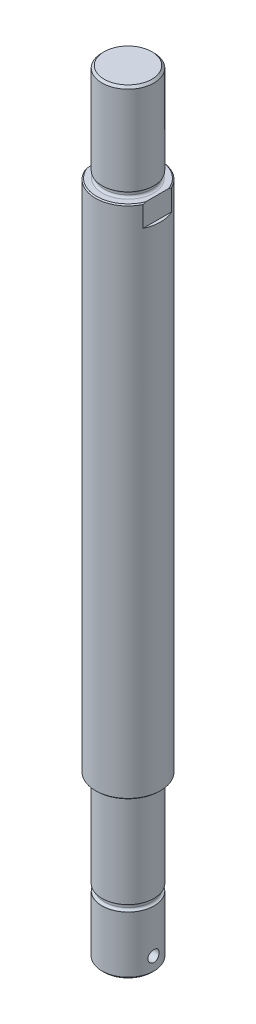
ISO-10303-21;
HEADER;
FILE_DESCRIPTION(('STEP AP214'),'2;1');
FILE_NAME('part.step','',(''),(''),'','','');
FILE_SCHEMA(('AUTOMOTIVE_DESIGN { 1 0 10303 214 1 1 1 1 }'));
ENDSEC;
DATA;
#1=APPLICATION_CONTEXT('core data for automotive mechanical design processes');
#2=APPLICATION_PROTOCOL_DEFINITION('international standard','automotive_design',2000,#1);
#3=PRODUCT_CONTEXT('',#1,'mechanical');
#4=PRODUCT('Part','Part','',(#3));
#5=PRODUCT_RELATED_PRODUCT_CATEGORY('part','',(#4));
#6=PRODUCT_DEFINITION_FORMATION('','',#4);
#7=PRODUCT_DEFINITION_CONTEXT('part definition',#1,'design');
#8=PRODUCT_DEFINITION('design','',#6,#7);
#9=PRODUCT_DEFINITION_SHAPE('','',#8);
#10=(LENGTH_UNIT() NAMED_UNIT(*) SI_UNIT(.MILLI.,.METRE.));
#11=(NAMED_UNIT(*) PLANE_ANGLE_UNIT() SI_UNIT($,.RADIAN.));
#12=(NAMED_UNIT(*) SI_UNIT($,.STERADIAN.) SOLID_ANGLE_UNIT());
#13=UNCERTAINTY_MEASURE_WITH_UNIT(LENGTH_MEASURE(1.E-05),#10,'distance_accuracy_value','');
#14=(GEOMETRIC_REPRESENTATION_CONTEXT(3) GLOBAL_UNCERTAINTY_ASSIGNED_CONTEXT((#13)) GLOBAL_UNIT_ASSIGNED_CONTEXT((#10,
#11,#12)) REPRESENTATION_CONTEXT('',''));
#15=CARTESIAN_POINT('',(0.,0.,0.));
#16=DIRECTION('',(0.,0.,1.));
#17=DIRECTION('',(1.,0.,0.));
#18=AXIS2_PLACEMENT_3D('',#15,#16,#17);
#19=CARTESIAN_POINT('',(0.,237.5,0.));
#20=DIRECTION('',(0.,1.,0.));
#21=DIRECTION('',(0.,0.,1.));
#22=AXIS2_PLACEMENT_3D('',#19,#20,#21);
#23=PLANE('',#22);
#24=CARTESIAN_POINT('',(0.,237.5,0.));
#25=DIRECTION('',(0.,1.,0.));
#26=DIRECTION('',(0.,0.,1.));
#27=AXIS2_PLACEMENT_3D('',#24,#25,#26);
#28=CIRCLE('',#27,11.85);
#29=CARTESIAN_POINT('',(0.,237.5,11.85));
#30=VERTEX_POINT('',#29);
#31=EDGE_CURVE('E113',#30,#30,#28,.F.);
#32=ORIENTED_EDGE('',*,*,#31,.T.);
#33=EDGE_LOOP('',(#32));
#34=FACE_BOUND('',#33,.T.);
#35=CARTESIAN_POINT('',(0.,237.5,0.));
#36=DIRECTION('',(0.,1.,0.));
#37=DIRECTION('',(0.,0.,1.));
#38=AXIS2_PLACEMENT_3D('',#35,#36,#37);
#39=CIRCLE('',#38,14.5);
#40=CARTESIAN_POINT('',(13.5,237.5,-5.29150262212917));
#41=VERTEX_POINT('',#40);
#42=CARTESIAN_POINT('',(-13.5,237.5,-5.29150262212918));
#43=VERTEX_POINT('',#42);
#44=EDGE_CURVE('E107',#41,#43,#39,.T.);
#45=ORIENTED_EDGE('',*,*,#44,.T.);
#46=DIRECTION('',(0.,0.,1.));
#47=VECTOR('',#46,1.);
#48=CARTESIAN_POINT('',(-13.5,237.5,-15.));
#49=LINE('',#48,#47);
#50=CARTESIAN_POINT('',(-13.5,237.5,5.29150262212918));
#51=VERTEX_POINT('',#50);
#52=EDGE_CURVE('E94',#43,#51,#49,.T.);
#53=ORIENTED_EDGE('',*,*,#52,.T.);
#54=CARTESIAN_POINT('',(13.5,237.5,5.29150262212918));
#55=VERTEX_POINT('',#54);
#56=EDGE_CURVE('E65',#51,#55,#39,.T.);
#57=ORIENTED_EDGE('',*,*,#56,.T.);
#58=DIRECTION('',(0.,0.,1.));
#59=VECTOR('',#58,1.);
#60=CARTESIAN_POINT('',(13.5,237.5,-15.));
#61=LINE('',#60,#59);
#62=EDGE_CURVE('E109',#41,#55,#61,.T.);
#63=ORIENTED_EDGE('',*,*,#62,.F.);
#64=EDGE_LOOP('',(#45,#53,#57,#63));
#65=FACE_BOUND('',#64,.T.);
#66=ADVANCED_FACE('F42',(#34,#65),#23,.T.);
#67=CARTESIAN_POINT('',(0.,237.5,0.));
#68=DIRECTION('',(0.,-1.,0.));
#69=DIRECTION('',(0.,0.,-1.));
#70=AXIS2_PLACEMENT_3D('',#67,#68,#69);
#71=CYLINDRICAL_SURFACE('',#70,15.);
#72=CARTESIAN_POINT('',(0.,0.500000000000084,0.));
#73=DIRECTION('',(0.,1.,0.));
#74=DIRECTION('',(0.,0.,1.));
#75=AXIS2_PLACEMENT_3D('',#72,#73,#74);
#76=CIRCLE('',#75,15.);
#77=CARTESIAN_POINT('',(0.,0.500000000000084,15.));
#78=VERTEX_POINT('',#77);
#79=EDGE_CURVE('E270',#78,#78,#76,.T.);
#80=ORIENTED_EDGE('',*,*,#79,.T.);
#81=EDGE_LOOP('',(#80));
#82=FACE_BOUND('',#81,.T.);
#83=DIRECTION('',(0.,-1.,0.));
#84=VECTOR('',#83,1.);
#85=CARTESIAN_POINT('',(-13.5,237.5,-6.53834841531101));
#86=LINE('',#85,#84);
#87=CARTESIAN_POINT('',(-13.5,237.,-6.53834841531101));
#88=VERTEX_POINT('',#87);
#89=CARTESIAN_POINT('',(-13.5,227.5,-6.53834841531101));
#90=VERTEX_POINT('',#89);
#91=EDGE_CURVE('E482',#88,#90,#86,.T.);
#92=ORIENTED_EDGE('',*,*,#91,.F.);
#93=CARTESIAN_POINT('',(0.,237.,0.));
#94=DIRECTION('',(0.,1.,0.));
#95=DIRECTION('',(0.,0.,1.));
#96=AXIS2_PLACEMENT_3D('',#93,#94,#95);
#97=CIRCLE('',#96,15.);
#98=CARTESIAN_POINT('',(13.5,237.,-6.53834841531101));
#99=VERTEX_POINT('',#98);
#100=EDGE_CURVE('E108',#88,#99,#97,.F.);
#101=ORIENTED_EDGE('',*,*,#100,.T.);
#102=DIRECTION('',(0.,-1.,0.));
#103=VECTOR('',#102,1.);
#104=CARTESIAN_POINT('',(13.5,237.5,-6.53834841531101));
#105=LINE('',#104,#103);
#106=CARTESIAN_POINT('',(13.5,227.5,-6.53834841531101));
#107=VERTEX_POINT('',#106);
#108=EDGE_CURVE('E134',#99,#107,#105,.T.);
#109=ORIENTED_EDGE('',*,*,#108,.T.);
#110=CARTESIAN_POINT('',(0.,227.5,0.));
#111=DIRECTION('',(0.,-1.,0.));
#112=DIRECTION('',(0.,0.,-1.));
#113=AXIS2_PLACEMENT_3D('',#110,#111,#112);
#114=CIRCLE('',#113,15.);
#115=CARTESIAN_POINT('',(13.5,227.5,6.53834841531101));
#116=VERTEX_POINT('',#115);
#117=EDGE_CURVE('E175',#107,#116,#114,.T.);
#118=ORIENTED_EDGE('',*,*,#117,.T.);
#119=DIRECTION('',(0.,-1.,0.));
#120=VECTOR('',#119,1.);
#121=CARTESIAN_POINT('',(13.5,237.5,6.53834841531101));
#122=LINE('',#121,#120);
#123=CARTESIAN_POINT('',(13.5,237.,6.53834841531101));
#124=VERTEX_POINT('',#123);
#125=EDGE_CURVE('E491',#116,#124,#122,.F.);
#126=ORIENTED_EDGE('',*,*,#125,.T.);
#127=CARTESIAN_POINT('',(-13.5,237.,6.53834841531102));
#128=VERTEX_POINT('',#127);
#129=EDGE_CURVE('E111',#124,#128,#97,.F.);
#130=ORIENTED_EDGE('',*,*,#129,.T.);
#131=DIRECTION('',(0.,-1.,0.));
#132=VECTOR('',#131,1.);
#133=CARTESIAN_POINT('',(-13.5,237.5,6.53834841531101));
#134=LINE('',#133,#132);
#135=CARTESIAN_POINT('',(-13.5,227.5,6.53834841531102));
#136=VERTEX_POINT('',#135);
#137=EDGE_CURVE('E57',#136,#128,#134,.F.);
#138=ORIENTED_EDGE('',*,*,#137,.F.);
#139=CARTESIAN_POINT('',(0.,227.5,0.));
#140=DIRECTION('',(0.,1.,0.));
#141=DIRECTION('',(0.,0.,1.));
#142=AXIS2_PLACEMENT_3D('',#139,#140,#141);
#143=CIRCLE('',#142,15.);
#144=EDGE_CURVE('E11',#90,#136,#143,.T.);
#145=ORIENTED_EDGE('',*,*,#144,.F.);
#146=EDGE_LOOP('',(#92,#101,#109,#118,#126,#130,#138,#145));
#147=FACE_BOUND('',#146,.T.);
#148=ADVANCED_FACE('F44',(#82,#147),#71,.T.);
#149=CARTESIAN_POINT('',(0.,237.5,0.));
#150=DIRECTION('',(0.,-1.,0.));
#151=DIRECTION('',(0.,0.,-1.));
#152=AXIS2_PLACEMENT_3D('',#149,#150,#151);
#153=CONICAL_SURFACE('',#152,14.5,0.785398163397474);
#154=ORIENTED_EDGE('',*,*,#100,.F.);
#155=CARTESIAN_POINT('',(-13.5,234.86575029128,-10.5514223250119));
#156=CARTESIAN_POINT('',(-13.5,235.023675256138,-10.2949329748632));
#157=CARTESIAN_POINT('',(-13.5,235.179051918212,-10.0368501978882));
#158=CARTESIAN_POINT('',(-13.5,235.483903332877,-9.51714051279044));
#159=CARTESIAN_POINT('',(-13.5,235.633376621784,-9.25551274705059));
#160=CARTESIAN_POINT('',(-13.5,235.926162908346,-8.72735342918814));
#161=CARTESIAN_POINT('',(-13.5,236.069446783711,-8.46080567497028));
#162=CARTESIAN_POINT('',(-13.5,236.348124555826,-7.92363206616421));
#163=CARTESIAN_POINT('',(-13.5,236.483518969805,-7.65300648038349));
#164=CARTESIAN_POINT('',(-13.5,236.747704155894,-7.10225189545895));
#165=CARTESIAN_POINT('',(-13.5,236.876323083585,-6.82203987302686));
#166=CARTESIAN_POINT('',(-13.5,237.122704738127,-6.25688713384685));
#167=CARTESIAN_POINT('',(-13.5,237.240466494002,-5.9719459968503));
#168=CARTESIAN_POINT('',(-13.5,237.574668792305,-5.11073018077389));
#169=CARTESIAN_POINT('',(-13.5,237.772583444338,-4.52692991213067));
#170=CARTESIAN_POINT('',(-13.5,238.032455852806,-3.59811922147092));
#171=CARTESIAN_POINT('',(-13.5,238.116181438579,-3.25912890069615));
#172=CARTESIAN_POINT('',(-13.5,238.260452119638,-2.57614089311397));
#173=CARTESIAN_POINT('',(-13.5,238.32099533729,-2.23214280304835));
#174=CARTESIAN_POINT('',(-13.5,238.416323056477,-1.54327979415033));
#175=CARTESIAN_POINT('',(-13.5,238.451303159985,-1.19844215688965));
#176=CARTESIAN_POINT('',(-13.5,238.494881916435,-0.50710817402677));
#177=CARTESIAN_POINT('',(-13.5,238.503483072576,-0.160611988936076));
#178=CARTESIAN_POINT('',(-13.5,238.494384743416,0.501303537014483));
#179=CARTESIAN_POINT('',(-13.5,238.4789478339,0.816756479238385));
#180=CARTESIAN_POINT('',(-13.5,238.426415198063,1.44584212190761));
#181=CARTESIAN_POINT('',(-13.5,238.389319305022,1.75947480832288));
#182=CARTESIAN_POINT('',(-13.5,238.294321063002,2.38582477871042));
#183=CARTESIAN_POINT('',(-13.5,238.236273179513,2.69851983808975));
#184=CARTESIAN_POINT('',(-13.5,238.101139371203,3.31968125384837));
#185=CARTESIAN_POINT('',(-13.5,238.024054864052,3.62814792331355));
#186=CARTESIAN_POINT('',(-13.5,237.772655191196,4.52666824684227));
#187=CARTESIAN_POINT('',(-13.5,237.574833338321,5.11024349553661));
#188=CARTESIAN_POINT('',(-13.5,237.240792190222,5.97113807942087));
#189=CARTESIAN_POINT('',(-13.5,237.123083343585,6.25598397889391));
#190=CARTESIAN_POINT('',(-13.5,236.876813448464,6.82094962563927));
#191=CARTESIAN_POINT('',(-13.5,236.748253410428,7.1010698100557));
#192=CARTESIAN_POINT('',(-13.5,236.484088782125,7.65185480567668));
#193=CARTESIAN_POINT('',(-13.5,236.34864897704,7.9225992252212));
#194=CARTESIAN_POINT('',(-13.5,236.069872340511,8.46000727587638));
#195=CARTESIAN_POINT('',(-13.5,235.92653497847,8.72667063125864));
#196=CARTESIAN_POINT('',(-13.5,235.633644190353,9.25504163402918));
#197=CARTESIAN_POINT('',(-13.5,235.484120315663,9.51676572166551));
#198=CARTESIAN_POINT('',(-13.5,235.179163440682,10.0366649244747));
#199=CARTESIAN_POINT('',(-13.5,235.023731916276,10.2948409043954));
#200=CARTESIAN_POINT('',(-13.5,234.86575029128,10.5514223250119));
#201=B_SPLINE_CURVE_WITH_KNOTS('',3,(#155,#156,#157,#158,#159,#160,#161,#162,#163,#164,#165,
#166,#167,#168,#169,#170,#171,#172,#173,#174,#175,#176,#177,#178,#179,#180,#181,#182,#183,#184,
#185,#186,#187,#188,#189,#190,#191,#192,#193,#194,#195,#196,#197,#198,#199,#200),.UNSPECIFIED.,
.F.,.F.,(4,2,2,2,2,2,2,2,2,2,2,2,2,2,2,2,2,2,2,2,2,2,4),(0.,0.903643742345897,1.8075101456999,
2.71524730011111,3.62292487671388,4.54765453819866,5.47246681970339,7.31831329759719,
8.36518526388691,9.41214200263708,10.4510013485046,11.4897621099565,12.436494634536,
13.3832344466139,14.3366811111008,15.2900567932716,17.1351388220336,18.0596297216637,
18.9840346286868,19.89209191828,20.8002102903674,21.7044027930883,22.6083708710038),.UNSPECIFIED.);
#202=EDGE_CURVE('E50',#88,#43,#201,.T.);
#203=ORIENTED_EDGE('',*,*,#202,.T.);
#204=ORIENTED_EDGE('',*,*,#44,.F.);
#205=CARTESIAN_POINT('',(13.5,234.86575029128,-10.5514223250119));
#206=CARTESIAN_POINT('',(13.5,235.023675256138,-10.2949329748632));
#207=CARTESIAN_POINT('',(13.5,235.179051918212,-10.0368501978883));
#208=CARTESIAN_POINT('',(13.5,235.483903332878,-9.51714051279045));
#209=CARTESIAN_POINT('',(13.5,235.633376621784,-9.25551274705059));
#210=CARTESIAN_POINT('',(13.5,235.926162908346,-8.72735342918814));
#211=CARTESIAN_POINT('',(13.5,236.069446783711,-8.46080567497029));
#212=CARTESIAN_POINT('',(13.5,236.348124555826,-7.92363206616422));
#213=CARTESIAN_POINT('',(13.5,236.483518969805,-7.65300648038351));
#214=CARTESIAN_POINT('',(13.5,236.747704155894,-7.10225189545897));
#215=CARTESIAN_POINT('',(13.5,236.876323083585,-6.82203987302687));
#216=CARTESIAN_POINT('',(13.5,237.122704738127,-6.25688713384686));
#217=CARTESIAN_POINT('',(13.5,237.240466494002,-5.97194599685031));
#218=CARTESIAN_POINT('',(13.5,237.574668792305,-5.11073018077389));
#219=CARTESIAN_POINT('',(13.5,237.772583444338,-4.52692991213067));
#220=CARTESIAN_POINT('',(13.5,238.032455852806,-3.59811922147091));
#221=CARTESIAN_POINT('',(13.5,238.116181438579,-3.25912890069615));
#222=CARTESIAN_POINT('',(13.5,238.260452119638,-2.57614089311397));
#223=CARTESIAN_POINT('',(13.5,238.32099533729,-2.23214280304835));
#224=CARTESIAN_POINT('',(13.5,238.416323056477,-1.54327979415033));
#225=CARTESIAN_POINT('',(13.5,238.451303159985,-1.19844215688965));
#226=CARTESIAN_POINT('',(13.5,238.494881916435,-0.507108174026769));
#227=CARTESIAN_POINT('',(13.5,238.503483072576,-0.160611988936074));
#228=CARTESIAN_POINT('',(13.5,238.494384743416,0.501303537014488));
#229=CARTESIAN_POINT('',(13.5,238.478947833901,0.816756479238392));
#230=CARTESIAN_POINT('',(13.5,238.426415198063,1.44584212190761));
#231=CARTESIAN_POINT('',(13.5,238.389319305022,1.75947480832288));
#232=CARTESIAN_POINT('',(13.5,238.294321063002,2.38582477871043));
#233=CARTESIAN_POINT('',(13.5,238.236273179513,2.69851983808976));
#234=CARTESIAN_POINT('',(13.5,238.101139371203,3.31968125384837));
#235=CARTESIAN_POINT('',(13.5,238.024054864052,3.62814792331355));
#236=CARTESIAN_POINT('',(13.5,237.772655191196,4.52666824684226));
#237=CARTESIAN_POINT('',(13.5,237.574833338321,5.11024349553661));
#238=CARTESIAN_POINT('',(13.5,237.240792190222,5.97113807942086));
#239=CARTESIAN_POINT('',(13.5,237.123083343585,6.2559839788939));
#240=CARTESIAN_POINT('',(13.5,236.876813448464,6.82094962563926));
#241=CARTESIAN_POINT('',(13.5,236.748253410428,7.1010698100557));
#242=CARTESIAN_POINT('',(13.5,236.484088782125,7.65185480567668));
#243=CARTESIAN_POINT('',(13.5,236.34864897704,7.9225992252212));
#244=CARTESIAN_POINT('',(13.5,236.069872340511,8.46000727587638));
#245=CARTESIAN_POINT('',(13.5,235.92653497847,8.72667063125864));
#246=CARTESIAN_POINT('',(13.5,235.633644190353,9.25504163402918));
#247=CARTESIAN_POINT('',(13.5,235.484120315663,9.51676572166551));
#248=CARTESIAN_POINT('',(13.5,235.179163440682,10.0366649244747));
#249=CARTESIAN_POINT('',(13.5,235.023731916276,10.2948409043954));
#250=CARTESIAN_POINT('',(13.5,234.86575029128,10.5514223250119));
#251=B_SPLINE_CURVE_WITH_KNOTS('',3,(#205,#206,#207,#208,#209,#210,#211,#212,#213,#214,#215,
#216,#217,#218,#219,#220,#221,#222,#223,#224,#225,#226,#227,#228,#229,#230,#231,#232,#233,#234,
#235,#236,#237,#238,#239,#240,#241,#242,#243,#244,#245,#246,#247,#248,#249,#250),.UNSPECIFIED.,
.F.,.F.,(4,2,2,2,2,2,2,2,2,2,2,2,2,2,2,2,2,2,2,2,2,2,4),(0.,0.90364374234591,1.80751014569991,
2.71524730011112,3.62292487671388,4.54765453819867,5.4724668197034,7.3183132975972,
8.36518526388693,9.4121420026371,10.4510013485047,11.4897621099565,12.436494634536,
13.3832344466139,14.3366811111008,15.2900567932716,17.1351388220336,18.0596297216637,
18.9840346286868,19.89209191828,20.8002102903674,21.7044027930884,22.6083708710039),.UNSPECIFIED.);
#252=EDGE_CURVE('E522',#99,#41,#251,.T.);
#253=ORIENTED_EDGE('',*,*,#252,.F.);
#254=EDGE_LOOP('',(#154,#203,#204,#253));
#255=FACE_BOUND('',#254,.T.);
#256=ADVANCED_FACE('F105',(#255),#153,.T.);
#257=ORIENTED_EDGE('',*,*,#56,.F.);
#258=EDGE_CURVE('E98',#51,#128,#201,.T.);
#259=ORIENTED_EDGE('',*,*,#258,.T.);
#260=ORIENTED_EDGE('',*,*,#129,.F.);
#261=EDGE_CURVE('E124',#55,#124,#251,.T.);
#262=ORIENTED_EDGE('',*,*,#261,.F.);
#263=EDGE_LOOP('',(#257,#259,#260,#262));
#264=FACE_BOUND('',#263,.T.);
#265=ADVANCED_FACE('F162',(#264),#153,.T.);
#266=CARTESIAN_POINT('',(0.,-74.,0.));
#267=DIRECTION('',(0.,1.,0.));
#268=DIRECTION('',(0.,0.,1.));
#269=AXIS2_PLACEMENT_3D('',#266,#267,#268);
#270=CYLINDRICAL_SURFACE('',#269,12.);
#271=CARTESIAN_POINT('',(0.,-1.,0.));
#272=DIRECTION('',(0.,1.,0.));
#273=DIRECTION('',(0.,0.,1.));
#274=AXIS2_PLACEMENT_3D('',#271,#272,#273);
#275=CIRCLE('',#274,12.);
#276=CARTESIAN_POINT('',(0.,-1.,12.));
#277=VERTEX_POINT('',#276);
#278=EDGE_CURVE('E284',#277,#277,#275,.F.);
#279=ORIENTED_EDGE('',*,*,#278,.T.);
#280=EDGE_LOOP('',(#279));
#281=FACE_BOUND('',#280,.T.);
#282=CARTESIAN_POINT('',(0.,-44.,0.));
#283=DIRECTION('',(0.,-1.,0.));
#284=DIRECTION('',(0.,0.,-1.));
#285=AXIS2_PLACEMENT_3D('',#282,#283,#284);
#286=CIRCLE('',#285,12.);
#287=CARTESIAN_POINT('',(0.,-44.,-12.));
#288=VERTEX_POINT('',#287);
#289=EDGE_CURVE('E296',#288,#288,#286,.T.);
#290=ORIENTED_EDGE('',*,*,#289,.F.);
#291=EDGE_LOOP('',(#290));
#292=FACE_BOUND('',#291,.T.);
#293=ADVANCED_FACE('F199',(#281,#292),#270,.T.);
#294=CARTESIAN_POINT('',(0.,0.,0.));
#295=DIRECTION('',(0.,1.,0.));
#296=DIRECTION('',(0.,0.,1.));
#297=AXIS2_PLACEMENT_3D('',#294,#295,#296);
#298=PLANE('',#297);
#299=CARTESIAN_POINT('',(0.,0.,0.));
#300=DIRECTION('',(0.,1.,0.));
#301=DIRECTION('',(0.,0.,1.));
#302=AXIS2_PLACEMENT_3D('',#299,#300,#301);
#303=CIRCLE('',#302,13.);
#304=CARTESIAN_POINT('',(0.,0.,13.));
#305=VERTEX_POINT('',#304);
#306=EDGE_CURVE('E288',#305,#305,#303,.T.);
#307=ORIENTED_EDGE('',*,*,#306,.T.);
#308=EDGE_LOOP('',(#307));
#309=FACE_BOUND('',#308,.T.);
#310=CARTESIAN_POINT('',(0.,0.,0.));
#311=DIRECTION('',(0.,1.,0.));
#312=DIRECTION('',(0.,0.,1.));
#313=AXIS2_PLACEMENT_3D('',#310,#311,#312);
#314=CIRCLE('',#313,14.4999999999999);
#315=CARTESIAN_POINT('',(0.,0.,14.4999999999999));
#316=VERTEX_POINT('',#315);
#317=EDGE_CURVE('E280',#316,#316,#314,.F.);
#318=ORIENTED_EDGE('',*,*,#317,.T.);
#319=EDGE_LOOP('',(#318));
#320=FACE_BOUND('',#319,.T.);
#321=ADVANCED_FACE('F195',(#309,#320),#298,.F.);
#322=CARTESIAN_POINT('',(0.,-47.,-10.85));
#323=DIRECTION('',(0.,1.,0.));
#324=DIRECTION('',(0.,0.,1.));
#325=AXIS2_PLACEMENT_3D('',#322,#323,#324);
#326=PLANE('',#325);
#327=CARTESIAN_POINT('',(0.,-47.,0.));
#328=DIRECTION('',(0.,1.,0.));
#329=DIRECTION('',(0.,0.,1.));
#330=AXIS2_PLACEMENT_3D('',#327,#328,#329);
#331=CIRCLE('',#330,11.85);
#332=CARTESIAN_POINT('',(0.,-47.,11.85));
#333=VERTEX_POINT('',#332);
#334=EDGE_CURVE('E267',#333,#333,#331,.F.);
#335=ORIENTED_EDGE('',*,*,#334,.T.);
#336=EDGE_LOOP('',(#335));
#337=FACE_BOUND('',#336,.T.);
#338=CARTESIAN_POINT('',(0.,-47.,0.));
#339=DIRECTION('',(0.,1.,0.));
#340=DIRECTION('',(0.,0.,1.));
#341=AXIS2_PLACEMENT_3D('',#338,#339,#340);
#342=CIRCLE('',#341,12.);
#343=CARTESIAN_POINT('',(0.,-47.,12.));
#344=VERTEX_POINT('',#343);
#345=EDGE_CURVE('E498',#344,#344,#342,.T.);
#346=ORIENTED_EDGE('',*,*,#345,.T.);
#347=EDGE_LOOP('',(#346));
#348=FACE_BOUND('',#347,.T.);
#349=ADVANCED_FACE('F198',(#337,#348),#326,.T.);
#350=CARTESIAN_POINT('',(0.,-44.,-10.85));
#351=DIRECTION('',(0.,-1.,0.));
#352=DIRECTION('',(0.,0.,-1.));
#353=AXIS2_PLACEMENT_3D('',#350,#351,#352);
#354=PLANE('',#353);
#355=CARTESIAN_POINT('',(0.,-44.,0.));
#356=DIRECTION('',(0.,-1.,0.));
#357=DIRECTION('',(0.,0.,-1.));
#358=AXIS2_PLACEMENT_3D('',#355,#356,#357);
#359=CIRCLE('',#358,11.85);
#360=CARTESIAN_POINT('',(0.,-44.,-11.85));
#361=VERTEX_POINT('',#360);
#362=EDGE_CURVE('E501',#361,#361,#359,.F.);
#363=ORIENTED_EDGE('',*,*,#362,.T.);
#364=EDGE_LOOP('',(#363));
#365=FACE_BOUND('',#364,.T.);
#366=ORIENTED_EDGE('',*,*,#289,.T.);
#367=EDGE_LOOP('',(#366));
#368=FACE_BOUND('',#367,.T.);
#369=ADVANCED_FACE('F245',(#365,#368),#354,.T.);
#370=CARTESIAN_POINT('',(0.,-0.90446020305357,0.));
#371=DIRECTION('',(0.,1.,0.));
#372=DIRECTION('',(0.,0.,1.));
#373=AXIS2_PLACEMENT_3D('',#370,#371,#372);
#374=CYLINDRICAL_SURFACE('',#373,10.85);
#375=CARTESIAN_POINT('',(0.,-45.,0.));
#376=DIRECTION('',(0.,-1.,0.));
#377=DIRECTION('',(0.,0.,-1.));
#378=AXIS2_PLACEMENT_3D('',#375,#376,#377);
#379=CIRCLE('',#378,10.85);
#380=CARTESIAN_POINT('',(0.,-45.,-10.85));
#381=VERTEX_POINT('',#380);
#382=EDGE_CURVE('E273',#381,#381,#379,.T.);
#383=ORIENTED_EDGE('',*,*,#382,.T.);
#384=EDGE_LOOP('',(#383));
#385=FACE_BOUND('',#384,.T.);
#386=CARTESIAN_POINT('',(0.,-46.,0.));
#387=DIRECTION('',(0.,1.,0.));
#388=DIRECTION('',(0.,0.,1.));
#389=AXIS2_PLACEMENT_3D('',#386,#387,#388);
#390=CIRCLE('',#389,10.85);
#391=CARTESIAN_POINT('',(0.,-46.,10.85));
#392=VERTEX_POINT('',#391);
#393=EDGE_CURVE('E504',#392,#392,#390,.T.);
#394=ORIENTED_EDGE('',*,*,#393,.T.);
#395=EDGE_LOOP('',(#394));
#396=FACE_BOUND('',#395,.T.);
#397=ADVANCED_FACE('F248',(#385,#396),#374,.T.);
#398=CARTESIAN_POINT('',(0.,-74.,0.));
#399=DIRECTION('',(0.,-1.,0.));
#400=DIRECTION('',(0.,0.,-1.));
#401=AXIS2_PLACEMENT_3D('',#398,#399,#400);
#402=PLANE('',#401);
#403=CARTESIAN_POINT('',(0.,-74.,0.));
#404=DIRECTION('',(0.,-1.,0.));
#405=DIRECTION('',(0.,0.,-1.));
#406=AXIS2_PLACEMENT_3D('',#403,#404,#405);
#407=CIRCLE('',#406,11.);
#408=CARTESIAN_POINT('',(0.,-74.,-11.));
#409=VERTEX_POINT('',#408);
#410=EDGE_CURVE('E264',#409,#409,#407,.T.);
#411=ORIENTED_EDGE('',*,*,#410,.T.);
#412=EDGE_LOOP('',(#411));
#413=FACE_BOUND('',#412,.T.);
#414=ADVANCED_FACE('F254',(#413),#402,.T.);
#415=CARTESIAN_POINT('',(-11.714947716486,-67.,-2.6));
#416=CARTESIAN_POINT('',(-11.7149506300318,-66.8558080710273,-2.59999499534855));
#417=CARTESIAN_POINT('',(-11.7176388577269,-66.7115556684161,-2.58796422285043));
#418=CARTESIAN_POINT('',(-11.7280820029083,-66.4271506860291,-2.54021023721585));
#419=CARTESIAN_POINT('',(-11.7358406279201,-66.2870011847446,-2.50446968696194));
#420=CARTESIAN_POINT('',(-11.7555055486852,-66.014957242693,-2.41047231141574));
#421=CARTESIAN_POINT('',(-11.7674073408381,-65.8830540211623,-2.3522399271288));
#422=CARTESIAN_POINT('',(-11.7940121510493,-65.6308871564469,-2.21498149637594));
#423=CARTESIAN_POINT('',(-11.8087151002375,-65.5106232272045,-2.13595596111856));
#424=CARTESIAN_POINT('',(-11.8395378925012,-65.2831526713299,-1.95795799972511));
#425=CARTESIAN_POINT('',(-11.8556755712714,-65.1761670973441,-1.85870612184277));
#426=CARTESIAN_POINT('',(-11.8873932725662,-64.9802254670654,-1.6436761932946));
#427=CARTESIAN_POINT('',(-11.90297325217,-64.8912707959896,-1.527896874078));
#428=CARTESIAN_POINT('',(-11.9320141366661,-64.7330435586562,-1.28161861627875));
#429=CARTESIAN_POINT('',(-11.9454515442086,-64.6639833139903,-1.15098025766274));
#430=CARTESIAN_POINT('',(-11.9684919123295,-64.5488785395322,-0.879612849767227));
#431=CARTESIAN_POINT('',(-11.978095294957,-64.5028314763105,-0.738884913160409));
#432=CARTESIAN_POINT('',(-11.9922595380827,-64.4357546061606,-0.453631049271651));
#433=CARTESIAN_POINT('',(-11.9968957117097,-64.4143507730548,-0.309196876165734));
#434=CARTESIAN_POINT('',(-12.0008640083932,-64.3959987972516,-0.0187183852466669));
#435=CARTESIAN_POINT('',(-12.0001967273276,-64.3990479071061,0.127325749835433));
#436=CARTESIAN_POINT('',(-11.9936909484855,-64.4292361132512,0.414301026380161));
#437=CARTESIAN_POINT('',(-11.9879389895303,-64.4559720871252,0.555276824288568));
#438=CARTESIAN_POINT('',(-11.972008636555,-64.5321330375282,0.830692063804957));
#439=CARTESIAN_POINT('',(-11.9618300448781,-64.5815590272102,0.965131213242464));
#440=CARTESIAN_POINT('',(-11.938050543506,-64.7020554818342,1.22477951337643));
#441=CARTESIAN_POINT('',(-11.924425503437,-64.7732793355749,1.3499151796383));
#442=CARTESIAN_POINT('',(-11.8952479893853,-64.9352354558006,1.58660567091398));
#443=CARTESIAN_POINT('',(-11.8796952575525,-65.0259703332948,1.69815867513292));
#444=CARTESIAN_POINT('',(-11.8479985747637,-65.2265694996877,1.90691424336683));
#445=CARTESIAN_POINT('',(-11.831849036322,-65.3367866073129,2.0037772190988));
#446=CARTESIAN_POINT('',(-11.8010768696216,-65.5720668635264,2.17770734206605));
#447=CARTESIAN_POINT('',(-11.7864542812042,-65.6971303993083,2.25477397284822));
#448=CARTESIAN_POINT('',(-11.7603772959716,-65.9590954414736,2.38707079423468));
#449=CARTESIAN_POINT('',(-11.7489320859654,-66.0960298026005,2.442237859949));
#450=CARTESIAN_POINT('',(-11.7306337989501,-66.3775318274,2.5286761309589));
#451=CARTESIAN_POINT('',(-11.7237800085877,-66.5220983015304,2.55995104840177));
#452=CARTESIAN_POINT('',(-11.7155857757038,-66.8116607447298,2.59719269835717));
#453=CARTESIAN_POINT('',(-11.714137731798,-66.9565902072316,2.60365343331654));
#454=CARTESIAN_POINT('',(-11.7166288478047,-67.2454554109202,2.59241985028294));
#455=CARTESIAN_POINT('',(-11.7205676451108,-67.3893912183379,2.57472715813843));
#456=CARTESIAN_POINT('',(-11.733287126794,-67.6704700165898,2.5161172545102));
#457=CARTESIAN_POINT('',(-11.7420112458403,-67.8076723445911,2.47547120265603));
#458=CARTESIAN_POINT('',(-11.7632675177894,-68.0733193444598,2.3724015541993));
#459=CARTESIAN_POINT('',(-11.7758000295249,-68.2017631896926,2.30997590540733));
#460=CARTESIAN_POINT('',(-11.8034980027527,-68.448387696241,2.16402732754586));
#461=CARTESIAN_POINT('',(-11.818700425937,-68.5663837098724,2.08019953748662));
#462=CARTESIAN_POINT('',(-11.8499273689652,-68.7868150156522,1.89422599437252));
#463=CARTESIAN_POINT('',(-11.8659519887228,-68.8892484106035,1.79207801125626));
#464=CARTESIAN_POINT('',(-11.8973718264988,-69.0775591607094,1.5701302619164));
#465=CARTESIAN_POINT('',(-11.9127502076758,-69.163100033166,1.45004222260282));
#466=CARTESIAN_POINT('',(-11.940837013015,-69.3127935410393,1.19691389957491));
#467=CARTESIAN_POINT('',(-11.9535455605824,-69.3769471650993,1.06387421492846));
#468=CARTESIAN_POINT('',(-11.974789690183,-69.4815739882757,0.789439876043625));
#469=CARTESIAN_POINT('',(-11.9833513621378,-69.5221955642303,0.648103900948652));
#470=CARTESIAN_POINT('',(-11.995449777427,-69.5790693853072,0.360407832534527));
#471=CARTESIAN_POINT('',(-11.998987236817,-69.5953251030922,0.214048458200617));
#472=CARTESIAN_POINT('',(-12.0006178834246,-69.602852086312,-0.0763433045858567));
#473=CARTESIAN_POINT('',(-11.9988206298237,-69.5946261235665,-0.220362276509871));
#474=CARTESIAN_POINT('',(-11.9902180245313,-69.5545461943411,-0.504913147396094));
#475=CARTESIAN_POINT('',(-11.9834127595999,-69.5226926371912,-0.645445106724542));
#476=CARTESIAN_POINT('',(-11.9655663169558,-69.4365007358202,-0.918652480291179));
#477=CARTESIAN_POINT('',(-11.9545383486205,-69.3822324676165,-1.05135091995899));
#478=CARTESIAN_POINT('',(-11.9294252118726,-69.2528204285857,-1.30582634329757));
#479=CARTESIAN_POINT('',(-11.9153397527671,-69.1776746726279,-1.42760228694814));
#480=CARTESIAN_POINT('',(-11.8853211156753,-69.0069949107404,-1.6592322644178));
#481=CARTESIAN_POINT('',(-11.8693583641116,-68.9111066303019,-1.76882143805989));
#482=CARTESIAN_POINT('',(-11.8375453740579,-68.702379890983,-1.97052545166517));
#483=CARTESIAN_POINT('',(-11.8216951635474,-68.5895373615876,-2.06263608318614));
#484=CARTESIAN_POINT('',(-11.7916713632252,-68.3483327282965,-2.22792599963231));
#485=CARTESIAN_POINT('',(-11.7775223839328,-68.2197871231464,-2.30084222447146));
#486=CARTESIAN_POINT('',(-11.7528114262808,-67.9519884932899,-2.42392133822829));
#487=CARTESIAN_POINT('',(-11.7422463889105,-67.8127447249674,-2.47410364362112));
#488=CARTESIAN_POINT('',(-11.7278707536719,-67.56111539032,-2.54124250613356));
#489=CARTESIAN_POINT('',(-11.7230565314123,-67.4501032577225,-2.56323463936519));
#490=CARTESIAN_POINT('',(-11.716593944907,-67.2260730792181,-2.59261500559943));
#491=CARTESIAN_POINT('',(-11.7149454320912,-67.1130551276975,-2.60000392394715));
#492=CARTESIAN_POINT('',(-11.714947716486,-67.,-2.6));
#493=B_SPLINE_CURVE_WITH_KNOTS('',3,(#415,#416,#417,#418,#419,#420,#421,#422,#423,#424,#425,
#426,#427,#428,#429,#430,#431,#432,#433,#434,#435,#436,#437,#438,#439,#440,#441,#442,#443,#444,
#445,#446,#447,#448,#449,#450,#451,#452,#453,#454,#455,#456,#457,#458,#459,#460,#461,#462,#463,
#464,#465,#466,#467,#468,#469,#470,#471,#472,#473,#474,#475,#476,#477,#478,#479,#480,#481,#482,
#483,#484,#485,#486,#487,#488,#489,#490,#491,#492),.UNSPECIFIED.,.T.,.F.,(4,2,2,2,2,2,2,2,2,2,2,
2,2,2,2,2,2,2,2,2,2,2,2,2,2,2,2,2,2,2,2,2,2,2,2,2,2,2,4),(0.,0.432161493823339,
0.864639342588276,1.29664855063136,1.72864713853472,2.16707728816394,2.60554110726701,
3.04852433811465,3.49145879195407,3.92757804331555,4.36364829451042,4.79243672630821,
5.22124430620136,5.65314157085302,6.08509666897979,6.52587314294718,6.96666111485845,
7.4087105772685,7.85069134402911,8.28382608870753,8.71693167906626,9.14502470737249,
9.57315808377853,10.0077679909163,10.4424308377474,10.885030955606,11.3276106110722,
11.7673684074967,12.2070635229448,12.6377914980315,13.0685120112598,13.4978960173906,
13.9273208653776,14.3647586634599,14.8023016535098,15.2455611281642,15.6884413088887,
16.0272977646139,16.3661383170515),.UNSPECIFIED.);
#494=CARTESIAN_POINT('',(-11.714947716486,-67.,-2.6));
#495=VERTEX_POINT('',#494);
#496=EDGE_CURVE('E133',#495,#495,#493,.T.);
#497=ORIENTED_EDGE('',*,*,#496,.T.);
#498=EDGE_LOOP('',(#497));
#499=FACE_BOUND('',#498,.T.);
#500=CARTESIAN_POINT('',(11.714947716486,-67.,-2.6));
#501=CARTESIAN_POINT('',(11.7149506300318,-67.1441919289727,-2.59999499534856));
#502=CARTESIAN_POINT('',(11.7176388577269,-67.2884443315839,-2.58796422285043));
#503=CARTESIAN_POINT('',(11.7280820029083,-67.5728493139709,-2.54021023721584));
#504=CARTESIAN_POINT('',(11.7358406279201,-67.7129988152555,-2.50446968696194));
#505=CARTESIAN_POINT('',(11.7555055486852,-67.985042757307,-2.41047231141574));
#506=CARTESIAN_POINT('',(11.7674073408381,-68.1169459788377,-2.35223992712881));
#507=CARTESIAN_POINT('',(11.7940121510493,-68.3691128435531,-2.21498149637595));
#508=CARTESIAN_POINT('',(11.8087151002375,-68.4893767727955,-2.13595596111856));
#509=CARTESIAN_POINT('',(11.8395378925012,-68.7168473286701,-1.95795799972511));
#510=CARTESIAN_POINT('',(11.8556755712714,-68.8238329026559,-1.85870612184277));
#511=CARTESIAN_POINT('',(11.8873932725662,-69.0197745329346,-1.6436761932946));
#512=CARTESIAN_POINT('',(11.90297325217,-69.1087292040104,-1.527896874078));
#513=CARTESIAN_POINT('',(11.9320141366661,-69.2669564413438,-1.28161861627875));
#514=CARTESIAN_POINT('',(11.9454515442086,-69.3360166860097,-1.15098025766274));
#515=CARTESIAN_POINT('',(11.9684919123295,-69.4511214604678,-0.879612849767234));
#516=CARTESIAN_POINT('',(11.978095294957,-69.4971685236896,-0.738884913160415));
#517=CARTESIAN_POINT('',(11.9922595380826,-69.5642453938394,-0.453631049271658));
#518=CARTESIAN_POINT('',(11.9968957117096,-69.5856492269452,-0.309196876165742));
#519=CARTESIAN_POINT('',(12.0008640083932,-69.6040012027484,-0.0187183852466753));
#520=CARTESIAN_POINT('',(12.0001967273276,-69.6009520928939,0.127325749835426));
#521=CARTESIAN_POINT('',(11.9936909484855,-69.5707638867488,0.414301026380157));
#522=CARTESIAN_POINT('',(11.9879389895303,-69.5440279128748,0.555276824288569));
#523=CARTESIAN_POINT('',(11.972008636555,-69.4678669624719,0.830692063804958));
#524=CARTESIAN_POINT('',(11.9618300448781,-69.4184409727898,0.965131213242461));
#525=CARTESIAN_POINT('',(11.9380505435059,-69.2979445181658,1.22477951337642));
#526=CARTESIAN_POINT('',(11.924425503437,-69.2267206644252,1.3499151796383));
#527=CARTESIAN_POINT('',(11.8952479893853,-69.0647645441995,1.58660567091398));
#528=CARTESIAN_POINT('',(11.8796952575525,-68.9740296667052,1.69815867513292));
#529=CARTESIAN_POINT('',(11.8479985747637,-68.7734305003123,1.90691424336682));
#530=CARTESIAN_POINT('',(11.831849036322,-68.6632133926871,2.0037772190988));
#531=CARTESIAN_POINT('',(11.8010768696216,-68.4279331364736,2.17770734206605));
#532=CARTESIAN_POINT('',(11.7864542812042,-68.3028696006917,2.25477397284822));
#533=CARTESIAN_POINT('',(11.7603772959716,-68.0409045585264,2.38707079423468));
#534=CARTESIAN_POINT('',(11.7489320859654,-67.9039701973995,2.44223785994899));
#535=CARTESIAN_POINT('',(11.7306337989501,-67.6224681726,2.5286761309589));
#536=CARTESIAN_POINT('',(11.7237800085877,-67.4779016984696,2.55995104840177));
#537=CARTESIAN_POINT('',(11.7155857757038,-67.1883392552702,2.59719269835717));
#538=CARTESIAN_POINT('',(11.714137731798,-67.0434097927685,2.60365343331654));
#539=CARTESIAN_POINT('',(11.7166288478047,-66.7545445890798,2.59241985028294));
#540=CARTESIAN_POINT('',(11.7205676451107,-66.6106087816621,2.57472715813843));
#541=CARTESIAN_POINT('',(11.733287126794,-66.3295299834102,2.51611725451019));
#542=CARTESIAN_POINT('',(11.7420112458403,-66.1923276554089,2.47547120265603));
#543=CARTESIAN_POINT('',(11.7632675177894,-65.9266806555402,2.3724015541993));
#544=CARTESIAN_POINT('',(11.7758000295249,-65.7982368103075,2.30997590540733));
#545=CARTESIAN_POINT('',(11.8034980027527,-65.551612303759,2.16402732754586));
#546=CARTESIAN_POINT('',(11.818700425937,-65.4336162901277,2.08019953748663));
#547=CARTESIAN_POINT('',(11.8499273689652,-65.2131849843478,1.89422599437253));
#548=CARTESIAN_POINT('',(11.8659519887228,-65.1107515893965,1.79207801125627));
#549=CARTESIAN_POINT('',(11.8973718264988,-64.9224408392906,1.57013026191641));
#550=CARTESIAN_POINT('',(11.9127502076758,-64.8368999668341,1.45004222260282));
#551=CARTESIAN_POINT('',(11.940837013015,-64.6872064589607,1.19691389957491));
#552=CARTESIAN_POINT('',(11.9535455605824,-64.6230528349007,1.06387421492846));
#553=CARTESIAN_POINT('',(11.974789690183,-64.5184260117243,0.789439876043625));
#554=CARTESIAN_POINT('',(11.9833513621378,-64.4778044357697,0.648103900948652));
#555=CARTESIAN_POINT('',(11.995449777427,-64.4209306146928,0.360407832534526));
#556=CARTESIAN_POINT('',(11.998987236817,-64.4046748969078,0.214048458200617));
#557=CARTESIAN_POINT('',(12.0006178834246,-64.397147913688,-0.0763433045858573));
#558=CARTESIAN_POINT('',(11.9988206298237,-64.4053738764335,-0.220362276509872));
#559=CARTESIAN_POINT('',(11.9902180245313,-64.4454538056589,-0.504913147396096));
#560=CARTESIAN_POINT('',(11.9834127595998,-64.4773073628088,-0.645445106724544));
#561=CARTESIAN_POINT('',(11.9655663169557,-64.5634992641798,-0.918652480291182));
#562=CARTESIAN_POINT('',(11.9545383486205,-64.6177675323836,-1.05135091995899));
#563=CARTESIAN_POINT('',(11.9294252118726,-64.7471795714143,-1.30582634329757));
#564=CARTESIAN_POINT('',(11.915339752767,-64.8223253273721,-1.42760228694814));
#565=CARTESIAN_POINT('',(11.8853211156753,-64.9930050892597,-1.6592322644178));
#566=CARTESIAN_POINT('',(11.8693583641116,-65.0888933696981,-1.76882143805989));
#567=CARTESIAN_POINT('',(11.8375453740579,-65.2976201090171,-1.97052545166516));
#568=CARTESIAN_POINT('',(11.8216951635473,-65.4104626384124,-2.06263608318614));
#569=CARTESIAN_POINT('',(11.7916713632252,-65.6516672717035,-2.2279259996323));
#570=CARTESIAN_POINT('',(11.7775223839328,-65.7802128768536,-2.30084222447145));
#571=CARTESIAN_POINT('',(11.7528114262808,-66.0480115067101,-2.42392133822829));
#572=CARTESIAN_POINT('',(11.7422463889104,-66.1872552750326,-2.47410364362113));
#573=CARTESIAN_POINT('',(11.7278707536718,-66.43888460968,-2.54124250613357));
#574=CARTESIAN_POINT('',(11.7230565314123,-66.5498967422775,-2.56323463936519));
#575=CARTESIAN_POINT('',(11.716593944907,-66.7739269207819,-2.59261500559943));
#576=CARTESIAN_POINT('',(11.7149454320911,-66.8869448723025,-2.60000392394715));
#577=CARTESIAN_POINT('',(11.714947716486,-67.,-2.6));
#578=B_SPLINE_CURVE_WITH_KNOTS('',3,(#500,#501,#502,#503,#504,#505,#506,#507,#508,#509,#510,
#511,#512,#513,#514,#515,#516,#517,#518,#519,#520,#521,#522,#523,#524,#525,#526,#527,#528,#529,
#530,#531,#532,#533,#534,#535,#536,#537,#538,#539,#540,#541,#542,#543,#544,#545,#546,#547,#548,
#549,#550,#551,#552,#553,#554,#555,#556,#557,#558,#559,#560,#561,#562,#563,#564,#565,#566,#567,
#568,#569,#570,#571,#572,#573,#574,#575,#576,#577),.UNSPECIFIED.,.T.,.F.,(4,2,2,2,2,2,2,2,2,2,2,
2,2,2,2,2,2,2,2,2,2,2,2,2,2,2,2,2,2,2,2,2,2,2,2,2,2,2,4),(0.,0.432161493823339,
0.864639342588277,1.29664855063135,1.72864713853472,2.16707728816394,2.60554110726701,
3.04852433811465,3.49145879195407,3.92757804331554,4.36364829451041,4.79243672630822,
5.22124430620136,5.65314157085302,6.08509666897979,6.52587314294718,6.96666111485845,
7.4087105772685,7.85069134402912,8.28382608870752,8.71693167906626,9.14502470737249,
9.57315808377853,10.0077679909163,10.4424308377474,10.885030955606,11.3276106110722,
11.7673684074967,12.2070635229448,12.6377914980315,13.0685120112598,13.4978960173906,
13.9273208653776,14.3647586634599,14.8023016535098,15.2455611281641,15.6884413088887,
16.0272977646139,16.3661383170515),.UNSPECIFIED.);
#579=CARTESIAN_POINT('',(11.714947716486,-67.,-2.6));
#580=VERTEX_POINT('',#579);
#581=EDGE_CURVE('E125',#580,#580,#578,.T.);
#582=ORIENTED_EDGE('',*,*,#581,.T.);
#583=EDGE_LOOP('',(#582));
#584=FACE_BOUND('',#583,.T.);
#585=CARTESIAN_POINT('',(0.,-73.,0.));
#586=DIRECTION('',(0.,-1.,0.));
#587=DIRECTION('',(0.,0.,-1.));
#588=AXIS2_PLACEMENT_3D('',#585,#586,#587);
#589=CIRCLE('',#588,12.);
#590=CARTESIAN_POINT('',(0.,-73.,-12.));
#591=VERTEX_POINT('',#590);
#592=EDGE_CURVE('E266',#591,#591,#589,.F.);
#593=ORIENTED_EDGE('',*,*,#592,.T.);
#594=EDGE_LOOP('',(#593));
#595=FACE_BOUND('',#594,.T.);
#596=ORIENTED_EDGE('',*,*,#345,.F.);
#597=EDGE_LOOP('',(#596));
#598=FACE_BOUND('',#597,.T.);
#599=ADVANCED_FACE('F139',(#499,#584,#595,#598),#270,.T.);
#600=CARTESIAN_POINT('',(0.,-45.,0.));
#601=DIRECTION('',(0.,-1.,0.));
#602=DIRECTION('',(0.,0.,-1.));
#603=AXIS2_PLACEMENT_3D('',#600,#601,#602);
#604=TOROIDAL_SURFACE('',#603,11.85,1.);
#605=ORIENTED_EDGE('',*,*,#382,.F.);
#606=EDGE_LOOP('',(#605));
#607=FACE_BOUND('',#606,.T.);
#608=ORIENTED_EDGE('',*,*,#362,.F.);
#609=EDGE_LOOP('',(#608));
#610=FACE_BOUND('',#609,.T.);
#611=ADVANCED_FACE('F240',(#607,#610),#604,.F.);
#612=CARTESIAN_POINT('',(0.,-46.,0.));
#613=DIRECTION('',(0.,1.,0.));
#614=DIRECTION('',(0.,0.,1.));
#615=AXIS2_PLACEMENT_3D('',#612,#613,#614);
#616=TOROIDAL_SURFACE('',#615,11.85,1.);
#617=ORIENTED_EDGE('',*,*,#334,.F.);
#618=EDGE_LOOP('',(#617));
#619=FACE_BOUND('',#618,.T.);
#620=ORIENTED_EDGE('',*,*,#393,.F.);
#621=EDGE_LOOP('',(#620));
#622=FACE_BOUND('',#621,.T.);
#623=ADVANCED_FACE('F236',(#619,#622),#616,.F.);
#624=CARTESIAN_POINT('',(0.,-74.,0.));
#625=DIRECTION('',(0.,1.,0.));
#626=DIRECTION('',(0.,0.,1.));
#627=AXIS2_PLACEMENT_3D('',#624,#625,#626);
#628=CONICAL_SURFACE('',#627,11.,0.785398163397447);
#629=ORIENTED_EDGE('',*,*,#592,.F.);
#630=EDGE_LOOP('',(#629));
#631=FACE_BOUND('',#630,.T.);
#632=ORIENTED_EDGE('',*,*,#410,.F.);
#633=EDGE_LOOP('',(#632));
#634=FACE_BOUND('',#633,.T.);
#635=ADVANCED_FACE('F232',(#631,#634),#628,.T.);
#636=CARTESIAN_POINT('',(0.,0.500000000000084,0.));
#637=DIRECTION('',(0.,1.,0.));
#638=DIRECTION('',(0.,0.,1.));
#639=AXIS2_PLACEMENT_3D('',#636,#637,#638);
#640=CONICAL_SURFACE('',#639,15.,0.785398163397457);
#641=ORIENTED_EDGE('',*,*,#317,.F.);
#642=EDGE_LOOP('',(#641));
#643=FACE_BOUND('',#642,.T.);
#644=ORIENTED_EDGE('',*,*,#79,.F.);
#645=EDGE_LOOP('',(#644));
#646=FACE_BOUND('',#645,.T.);
#647=ADVANCED_FACE('F228',(#643,#646),#640,.T.);
#648=CARTESIAN_POINT('',(0.,-1.,0.));
#649=DIRECTION('',(0.,1.,0.));
#650=DIRECTION('',(0.,0.,1.));
#651=AXIS2_PLACEMENT_3D('',#648,#649,#650);
#652=TOROIDAL_SURFACE('',#651,13.,1.);
#653=ORIENTED_EDGE('',*,*,#306,.F.);
#654=EDGE_LOOP('',(#653));
#655=FACE_BOUND('',#654,.T.);
#656=ORIENTED_EDGE('',*,*,#278,.F.);
#657=EDGE_LOOP('',(#656));
#658=FACE_BOUND('',#657,.T.);
#659=ADVANCED_FACE('F220',(#655,#658),#652,.F.);
#660=CARTESIAN_POINT('',(0.,240.5,-13.1491126094706));
#661=DIRECTION('',(0.,1.,0.));
#662=DIRECTION('',(0.,0.,1.));
#663=AXIS2_PLACEMENT_3D('',#660,#661,#662);
#664=PLANE('',#663);
#665=CARTESIAN_POINT('',(0.,240.5,0.));
#666=DIRECTION('',(0.,1.,0.));
#667=DIRECTION('',(0.,0.,1.));
#668=AXIS2_PLACEMENT_3D('',#665,#666,#667);
#669=CIRCLE('',#668,11.85);
#670=CARTESIAN_POINT('',(0.,240.5,11.85));
#671=VERTEX_POINT('',#670);
#672=EDGE_CURVE('E300',#671,#671,#669,.T.);
#673=ORIENTED_EDGE('',*,*,#672,.T.);
#674=EDGE_LOOP('',(#673));
#675=FACE_BOUND('',#674,.T.);
#676=CARTESIAN_POINT('',(0.,240.5,0.));
#677=DIRECTION('',(0.,1.,0.));
#678=DIRECTION('',(0.,0.,1.));
#679=AXIS2_PLACEMENT_3D('',#676,#677,#678);
#680=CIRCLE('',#679,12.);
#681=CARTESIAN_POINT('',(0.,240.5,-12.));
#682=VERTEX_POINT('',#681);
#683=EDGE_CURVE('E293',#682,#682,#680,.T.);
#684=ORIENTED_EDGE('',*,*,#683,.F.);
#685=EDGE_LOOP('',(#684));
#686=FACE_BOUND('',#685,.T.);
#687=ADVANCED_FACE('F212',(#675,#686),#664,.F.);
#688=CARTESIAN_POINT('',(0.,237.5,0.));
#689=DIRECTION('',(0.,-1.,0.));
#690=DIRECTION('',(0.,0.,-1.));
#691=AXIS2_PLACEMENT_3D('',#688,#689,#690);
#692=CYLINDRICAL_SURFACE('',#691,10.85);
#693=CARTESIAN_POINT('',(0.,239.5,0.));
#694=DIRECTION('',(0.,1.,0.));
#695=DIRECTION('',(0.,0.,1.));
#696=AXIS2_PLACEMENT_3D('',#693,#694,#695);
#697=CIRCLE('',#696,10.85);
#698=CARTESIAN_POINT('',(0.,239.5,10.85));
#699=VERTEX_POINT('',#698);
#700=EDGE_CURVE('E299',#699,#699,#697,.F.);
#701=ORIENTED_EDGE('',*,*,#700,.T.);
#702=EDGE_LOOP('',(#701));
#703=FACE_BOUND('',#702,.T.);
#704=CARTESIAN_POINT('',(0.,238.5,0.));
#705=DIRECTION('',(0.,1.,0.));
#706=DIRECTION('',(0.,0.,1.));
#707=AXIS2_PLACEMENT_3D('',#704,#705,#706);
#708=CIRCLE('',#707,10.85);
#709=CARTESIAN_POINT('',(0.,238.5,10.85));
#710=VERTEX_POINT('',#709);
#711=EDGE_CURVE('E292',#710,#710,#708,.T.);
#712=ORIENTED_EDGE('',*,*,#711,.T.);
#713=EDGE_LOOP('',(#712));
#714=FACE_BOUND('',#713,.T.);
#715=ADVANCED_FACE('F207',(#703,#714),#692,.T.);
#716=CARTESIAN_POINT('',(0.,282.5,0.));
#717=DIRECTION('',(0.,1.,0.));
#718=DIRECTION('',(0.,0.,1.));
#719=AXIS2_PLACEMENT_3D('',#716,#717,#718);
#720=PLANE('',#719);
#721=CARTESIAN_POINT('',(0.,282.5,0.));
#722=DIRECTION('',(0.,1.,0.));
#723=DIRECTION('',(0.,0.,1.));
#724=AXIS2_PLACEMENT_3D('',#721,#722,#723);
#725=CIRCLE('',#724,11.);
#726=CARTESIAN_POINT('',(0.,282.5,11.));
#727=VERTEX_POINT('',#726);
#728=EDGE_CURVE('E118',#727,#727,#725,.T.);
#729=ORIENTED_EDGE('',*,*,#728,.T.);
#730=EDGE_LOOP('',(#729));
#731=FACE_BOUND('',#730,.T.);
#732=ADVANCED_FACE('F204',(#731),#720,.T.);
#733=CARTESIAN_POINT('',(0.,282.5,0.));
#734=DIRECTION('',(0.,-1.,0.));
#735=DIRECTION('',(0.,0.,-1.));
#736=AXIS2_PLACEMENT_3D('',#733,#734,#735);
#737=CYLINDRICAL_SURFACE('',#736,12.);
#738=CARTESIAN_POINT('',(0.,281.5,0.));
#739=DIRECTION('',(0.,1.,0.));
#740=DIRECTION('',(0.,0.,1.));
#741=AXIS2_PLACEMENT_3D('',#738,#739,#740);
#742=CIRCLE('',#741,12.);
#743=CARTESIAN_POINT('',(0.,281.5,-12.));
#744=VERTEX_POINT('',#743);
#745=EDGE_CURVE('E121',#744,#744,#742,.F.);
#746=CARTESIAN_POINT('',(0.,281.5,-12.));
#747=CARTESIAN_POINT('',(0.,281.072916666667,-12.));
#748=CARTESIAN_POINT('',(0.,280.645833333333,-12.));
#749=CARTESIAN_POINT('',(0.,279.791666666667,-12.));
#750=CARTESIAN_POINT('',(0.,279.364583333333,-12.));
#751=CARTESIAN_POINT('',(0.,278.510416666667,-12.));
#752=CARTESIAN_POINT('',(0.,278.083333333333,-12.));
#753=CARTESIAN_POINT('',(0.,277.229166666667,-12.));
#754=CARTESIAN_POINT('',(0.,276.802083333333,-12.));
#755=CARTESIAN_POINT('',(0.,275.947916666667,-12.));
#756=CARTESIAN_POINT('',(0.,275.520833333333,-12.));
#757=CARTESIAN_POINT('',(0.,274.666666666667,-12.));
#758=CARTESIAN_POINT('',(0.,274.239583333333,-12.));
#759=CARTESIAN_POINT('',(0.,273.385416666667,-12.));
#760=CARTESIAN_POINT('',(0.,272.958333333333,-12.));
#761=CARTESIAN_POINT('',(0.,272.104166666667,-12.));
#762=CARTESIAN_POINT('',(0.,271.677083333333,-12.));
#763=CARTESIAN_POINT('',(0.,270.822916666667,-12.));
#764=CARTESIAN_POINT('',(0.,270.395833333333,-12.));
#765=CARTESIAN_POINT('',(0.,269.541666666667,-12.));
#766=CARTESIAN_POINT('',(0.,269.114583333333,-12.));
#767=CARTESIAN_POINT('',(0.,268.260416666667,-12.));
#768=CARTESIAN_POINT('',(0.,267.833333333333,-12.));
#769=CARTESIAN_POINT('',(0.,266.979166666667,-12.));
#770=CARTESIAN_POINT('',(0.,266.552083333333,-12.));
#771=CARTESIAN_POINT('',(0.,265.697916666667,-12.));
#772=CARTESIAN_POINT('',(0.,265.270833333333,-12.));
#773=CARTESIAN_POINT('',(0.,264.416666666667,-12.));
#774=CARTESIAN_POINT('',(0.,263.989583333333,-12.));
#775=CARTESIAN_POINT('',(0.,263.135416666667,-12.));
#776=CARTESIAN_POINT('',(0.,262.708333333333,-12.));
#777=CARTESIAN_POINT('',(0.,261.854166666667,-12.));
#778=CARTESIAN_POINT('',(0.,261.427083333333,-12.));
#779=CARTESIAN_POINT('',(0.,260.572916666667,-12.));
#780=CARTESIAN_POINT('',(0.,260.145833333333,-12.));
#781=CARTESIAN_POINT('',(0.,259.291666666667,-12.));
#782=CARTESIAN_POINT('',(0.,258.864583333333,-12.));
#783=CARTESIAN_POINT('',(0.,258.010416666667,-12.));
#784=CARTESIAN_POINT('',(0.,257.583333333333,-12.));
#785=CARTESIAN_POINT('',(0.,256.729166666667,-12.));
#786=CARTESIAN_POINT('',(0.,256.302083333333,-12.));
#787=CARTESIAN_POINT('',(0.,255.447916666667,-12.));
#788=CARTESIAN_POINT('',(0.,255.020833333333,-12.));
#789=CARTESIAN_POINT('',(0.,254.166666666667,-12.));
#790=CARTESIAN_POINT('',(0.,253.739583333333,-12.));
#791=CARTESIAN_POINT('',(0.,252.885416666667,-12.));
#792=CARTESIAN_POINT('',(0.,252.458333333333,-12.));
#793=CARTESIAN_POINT('',(0.,251.604166666667,-12.));
#794=CARTESIAN_POINT('',(0.,251.177083333333,-12.));
#795=CARTESIAN_POINT('',(0.,250.322916666667,-12.));
#796=CARTESIAN_POINT('',(0.,249.895833333333,-12.));
#797=CARTESIAN_POINT('',(0.,249.041666666667,-12.));
#798=CARTESIAN_POINT('',(0.,248.614583333333,-12.));
#799=CARTESIAN_POINT('',(0.,247.760416666667,-12.));
#800=CARTESIAN_POINT('',(0.,247.333333333333,-12.));
#801=CARTESIAN_POINT('',(0.,246.479166666667,-12.));
#802=CARTESIAN_POINT('',(0.,246.052083333333,-12.));
#803=CARTESIAN_POINT('',(0.,245.197916666667,-12.));
#804=CARTESIAN_POINT('',(0.,244.770833333333,-12.));
#805=CARTESIAN_POINT('',(0.,243.916666666667,-12.));
#806=CARTESIAN_POINT('',(0.,243.489583333333,-12.));
#807=CARTESIAN_POINT('',(0.,242.635416666667,-12.));
#808=CARTESIAN_POINT('',(0.,242.208333333333,-12.));
#809=CARTESIAN_POINT('',(0.,241.354166666667,-12.));
#810=CARTESIAN_POINT('',(0.,240.927083333333,-12.));
#811=CARTESIAN_POINT('',(0.,240.5,-12.));
#812=B_SPLINE_CURVE_WITH_KNOTS('',3,(#746,#747,#748,#749,#750,#751,#752,#753,#754,#755,#756,
#757,#758,#759,#760,#761,#762,#763,#764,#765,#766,#767,#768,#769,#770,#771,#772,#773,#774,#775,
#776,#777,#778,#779,#780,#781,#782,#783,#784,#785,#786,#787,#788,#789,#790,#791,#792,#793,#794,
#795,#796,#797,#798,#799,#800,#801,#802,#803,#804,#805,#806,#807,#808,#809,#810,#811),
.UNSPECIFIED.,.F.,.F.,(4,2,2,2,2,2,2,2,2,2,2,2,2,2,2,2,2,2,2,2,2,2,2,2,2,2,2,2,2,2,2,2,4),(0.,
1.28124999999996,2.56249999999997,3.84374999999998,5.12499999999999,6.40624999999995,
7.68749999999996,8.96874999999997,10.25,11.5312499999999,12.8124999999999,14.09375,15.375,
16.65625,17.9374999999999,19.21875,20.5,21.78125,23.0624999999999,24.3437499999999,25.625,
26.90625,28.1875,29.4687499999999,30.7499999999999,32.03125,33.3124999999999,34.59375,
35.8749999999999,37.1562499999999,38.4375,39.7187499999999,41.),.UNSPECIFIED.);
#813=EDGE_CURVE('BSEAM201',#744,#682,#812,.T.);
#814=ORIENTED_EDGE('',*,*,#745,.T.);
#815=ORIENTED_EDGE('',*,*,#683,.T.);
#816=ORIENTED_EDGE('',*,*,#813,.T.);
#817=ORIENTED_EDGE('',*,*,#813,.F.);
#818=EDGE_LOOP('',(#814,#816,#815,#817));
#819=FACE_BOUND('',#818,.T.);
#820=ADVANCED_FACE('F201',(#819),#737,.T.);
#821=CARTESIAN_POINT('',(0.,239.5,0.));
#822=DIRECTION('',(0.,1.,0.));
#823=DIRECTION('',(0.,0.,1.));
#824=AXIS2_PLACEMENT_3D('',#821,#822,#823);
#825=TOROIDAL_SURFACE('',#824,11.85,1.);
#826=ORIENTED_EDGE('',*,*,#672,.F.);
#827=EDGE_LOOP('',(#826));
#828=FACE_BOUND('',#827,.T.);
#829=ORIENTED_EDGE('',*,*,#700,.F.);
#830=EDGE_LOOP('',(#829));
#831=FACE_BOUND('',#830,.T.);
#832=ADVANCED_FACE('F203',(#828,#831),#825,.F.);
#833=CARTESIAN_POINT('',(0.,238.5,0.));
#834=DIRECTION('',(0.,1.,0.));
#835=DIRECTION('',(0.,0.,1.));
#836=AXIS2_PLACEMENT_3D('',#833,#834,#835);
#837=TOROIDAL_SURFACE('',#836,11.85,1.);
#838=ORIENTED_EDGE('',*,*,#711,.F.);
#839=EDGE_LOOP('',(#838));
#840=FACE_BOUND('',#839,.T.);
#841=ORIENTED_EDGE('',*,*,#31,.F.);
#842=EDGE_LOOP('',(#841));
#843=FACE_BOUND('',#842,.T.);
#844=ADVANCED_FACE('F157',(#840,#843),#837,.F.);
#845=CARTESIAN_POINT('',(0.,282.5,0.));
#846=DIRECTION('',(0.,-1.,0.));
#847=DIRECTION('',(0.,0.,-1.));
#848=AXIS2_PLACEMENT_3D('',#845,#846,#847);
#849=CONICAL_SURFACE('',#848,11.,0.785398163397446);
#850=ORIENTED_EDGE('',*,*,#745,.F.);
#851=EDGE_LOOP('',(#850));
#852=FACE_BOUND('',#851,.T.);
#853=ORIENTED_EDGE('',*,*,#728,.F.);
#854=EDGE_LOOP('',(#853));
#855=FACE_BOUND('',#854,.T.);
#856=ADVANCED_FACE('F149',(#852,#855),#849,.T.);
#857=CARTESIAN_POINT('',(-15.,-67.,0.));
#858=DIRECTION('',(1.,0.,0.));
#859=DIRECTION('',(0.,0.,-1.));
#860=AXIS2_PLACEMENT_3D('',#857,#858,#859);
#861=CYLINDRICAL_SURFACE('',#860,2.6);
#862=ORIENTED_EDGE('',*,*,#581,.F.);
#863=EDGE_LOOP('',(#862));
#864=FACE_BOUND('',#863,.T.);
#865=ORIENTED_EDGE('',*,*,#496,.F.);
#866=EDGE_LOOP('',(#865));
#867=FACE_BOUND('',#866,.T.);
#868=ADVANCED_FACE('F143',(#864,#867),#861,.F.);
#869=CARTESIAN_POINT('',(13.5,227.5,-15.));
#870=DIRECTION('',(0.,-1.,0.));
#871=DIRECTION('',(0.,0.,-1.));
#872=AXIS2_PLACEMENT_3D('',#869,#870,#871);
#873=PLANE('',#872);
#874=DIRECTION('',(0.,0.,1.));
#875=VECTOR('',#874,1.);
#876=CARTESIAN_POINT('',(13.5,227.5,-15.));
#877=LINE('',#876,#875);
#878=EDGE_CURVE('E487',#107,#116,#877,.T.);
#879=ORIENTED_EDGE('',*,*,#878,.T.);
#880=ORIENTED_EDGE('',*,*,#117,.F.);
#881=EDGE_LOOP('',(#879,#880));
#882=FACE_BOUND('',#881,.T.);
#883=ADVANCED_FACE('F148',(#882),#873,.F.);
#884=CARTESIAN_POINT('',(13.5,227.5,-15.));
#885=DIRECTION('',(-1.,0.,0.));
#886=DIRECTION('',(0.,0.,1.));
#887=AXIS2_PLACEMENT_3D('',#884,#885,#886);
#888=PLANE('',#887);
#889=ORIENTED_EDGE('',*,*,#252,.T.);
#890=ORIENTED_EDGE('',*,*,#62,.T.);
#891=ORIENTED_EDGE('',*,*,#261,.T.);
#892=ORIENTED_EDGE('',*,*,#125,.F.);
#893=ORIENTED_EDGE('',*,*,#878,.F.);
#894=ORIENTED_EDGE('',*,*,#108,.F.);
#895=EDGE_LOOP('',(#889,#890,#891,#892,#893,#894));
#896=FACE_BOUND('',#895,.T.);
#897=ADVANCED_FACE('F151',(#896),#888,.F.);
#898=CARTESIAN_POINT('',(-13.5,227.5,-15.));
#899=DIRECTION('',(0.,1.,0.));
#900=DIRECTION('',(0.,0.,1.));
#901=AXIS2_PLACEMENT_3D('',#898,#899,#900);
#902=PLANE('',#901);
#903=ORIENTED_EDGE('',*,*,#144,.T.);
#904=DIRECTION('',(0.,0.,1.));
#905=VECTOR('',#904,1.);
#906=CARTESIAN_POINT('',(-13.5,227.5,-15.));
#907=LINE('',#906,#905);
#908=EDGE_CURVE('E100',#90,#136,#907,.T.);
#909=ORIENTED_EDGE('',*,*,#908,.F.);
#910=EDGE_LOOP('',(#903,#909));
#911=FACE_BOUND('',#910,.T.);
#912=ADVANCED_FACE('F179',(#911),#902,.T.);
#913=CARTESIAN_POINT('',(-13.5,227.5,-15.));
#914=DIRECTION('',(-1.,0.,0.));
#915=DIRECTION('',(0.,0.,1.));
#916=AXIS2_PLACEMENT_3D('',#913,#914,#915);
#917=PLANE('',#916);
#918=ORIENTED_EDGE('',*,*,#91,.T.);
#919=ORIENTED_EDGE('',*,*,#908,.T.);
#920=ORIENTED_EDGE('',*,*,#137,.T.);
#921=ORIENTED_EDGE('',*,*,#258,.F.);
#922=ORIENTED_EDGE('',*,*,#52,.F.);
#923=ORIENTED_EDGE('',*,*,#202,.F.);
#924=EDGE_LOOP('',(#918,#919,#920,#921,#922,#923));
#925=FACE_BOUND('',#924,.T.);
#926=ADVANCED_FACE('F96',(#925),#917,.T.);
#927=CLOSED_SHELL('',(#66,#148,#256,#265,#293,#321,#349,#369,#397,#414,#599,#611,#623,#635,#647,
#659,#687,#715,#732,#820,#832,#844,#856,#868,#883,#897,#912,#926));
#928=MANIFOLD_SOLID_BREP('B2',#927);
#929=ADVANCED_BREP_SHAPE_REPRESENTATION('',(#18,#928),#14);
#930=SHAPE_DEFINITION_REPRESENTATION(#9,#929);
ENDSEC;
END-ISO-10303-21;
